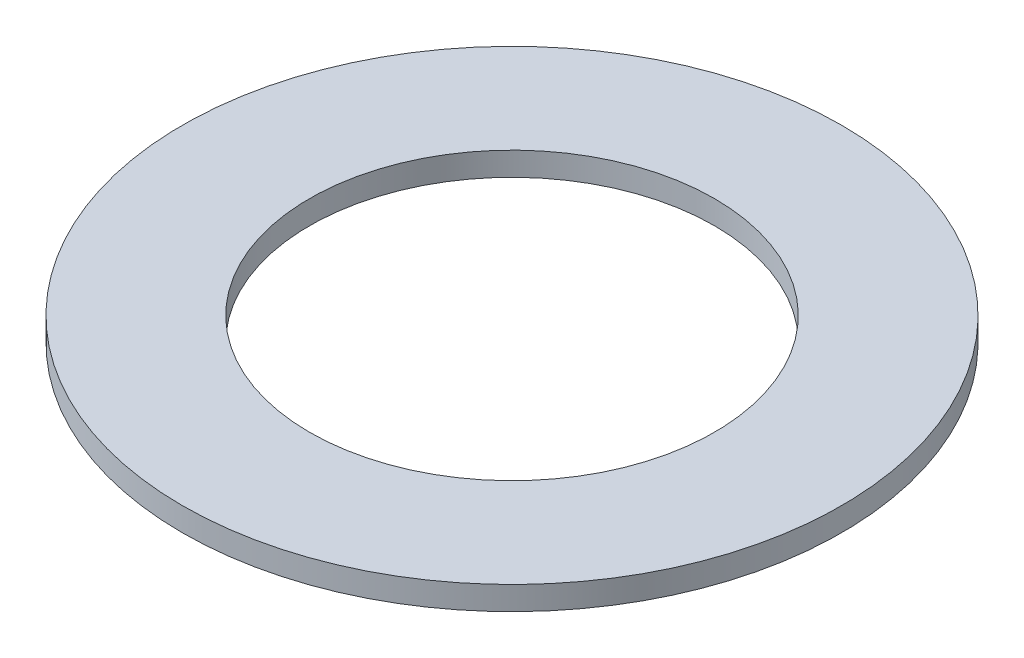
ISO-10303-21;
HEADER;
FILE_DESCRIPTION(('STEP AP214'),'2;1');
FILE_NAME('part.step','',(''),(''),'','','');
FILE_SCHEMA(('AUTOMOTIVE_DESIGN { 1 0 10303 214 1 1 1 1 }'));
ENDSEC;
DATA;
#1=APPLICATION_CONTEXT('core data for automotive mechanical design processes');
#2=APPLICATION_PROTOCOL_DEFINITION('international standard','automotive_design',2000,#1);
#3=PRODUCT_CONTEXT('',#1,'mechanical');
#4=PRODUCT('Part','Part','',(#3));
#5=PRODUCT_RELATED_PRODUCT_CATEGORY('part','',(#4));
#6=PRODUCT_DEFINITION_FORMATION('','',#4);
#7=PRODUCT_DEFINITION_CONTEXT('part definition',#1,'design');
#8=PRODUCT_DEFINITION('design','',#6,#7);
#9=PRODUCT_DEFINITION_SHAPE('','',#8);
#10=(LENGTH_UNIT() NAMED_UNIT(*) SI_UNIT(.MILLI.,.METRE.));
#11=(NAMED_UNIT(*) PLANE_ANGLE_UNIT() SI_UNIT($,.RADIAN.));
#12=(NAMED_UNIT(*) SI_UNIT($,.STERADIAN.) SOLID_ANGLE_UNIT());
#13=UNCERTAINTY_MEASURE_WITH_UNIT(LENGTH_MEASURE(1.E-05),#10,'distance_accuracy_value','');
#14=(GEOMETRIC_REPRESENTATION_CONTEXT(3) GLOBAL_UNCERTAINTY_ASSIGNED_CONTEXT((#13)) GLOBAL_UNIT_ASSIGNED_CONTEXT((#10,
#11,#12)) REPRESENTATION_CONTEXT('',''));
#15=CARTESIAN_POINT('',(0.,0.,0.));
#16=DIRECTION('',(0.,0.,1.));
#17=DIRECTION('',(1.,0.,0.));
#18=AXIS2_PLACEMENT_3D('',#15,#16,#17);
#19=CARTESIAN_POINT('',(0.,0.5,0.));
#20=DIRECTION('',(0.,1.,0.));
#21=DIRECTION('',(0.,0.,1.));
#22=AXIS2_PLACEMENT_3D('',#19,#20,#21);
#23=PLANE('',#22);
#24=CARTESIAN_POINT('',(0.,0.5,0.));
#25=DIRECTION('',(0.,1.,0.));
#26=DIRECTION('',(0.,0.,1.));
#27=AXIS2_PLACEMENT_3D('',#24,#25,#26);
#28=CIRCLE('',#27,7.);
#29=CARTESIAN_POINT('',(0.,0.5,7.));
#30=VERTEX_POINT('',#29);
#31=EDGE_CURVE('E10',#30,#30,#28,.T.);
#32=ORIENTED_EDGE('',*,*,#31,.T.);
#33=EDGE_LOOP('',(#32));
#34=FACE_BOUND('',#33,.T.);
#35=CARTESIAN_POINT('',(0.,0.5,0.));
#36=DIRECTION('',(0.,1.,0.));
#37=DIRECTION('',(0.,0.,1.));
#38=AXIS2_PLACEMENT_3D('',#35,#36,#37);
#39=CIRCLE('',#38,4.3);
#40=CARTESIAN_POINT('',(0.,0.5,4.3));
#41=VERTEX_POINT('',#40);
#42=EDGE_CURVE('E50',#41,#41,#39,.T.);
#43=ORIENTED_EDGE('',*,*,#42,.F.);
#44=EDGE_LOOP('',(#43));
#45=FACE_BOUND('',#44,.T.);
#46=ADVANCED_FACE('F37',(#34,#45),#23,.T.);
#47=CARTESIAN_POINT('',(0.,0.,0.));
#48=DIRECTION('',(0.,1.,0.));
#49=DIRECTION('',(0.,0.,1.));
#50=AXIS2_PLACEMENT_3D('',#47,#48,#49);
#51=PLANE('',#50);
#52=CARTESIAN_POINT('',(0.,0.,0.));
#53=DIRECTION('',(0.,1.,0.));
#54=DIRECTION('',(0.,0.,1.));
#55=AXIS2_PLACEMENT_3D('',#52,#53,#54);
#56=CIRCLE('',#55,7.);
#57=CARTESIAN_POINT('',(0.,0.,7.));
#58=VERTEX_POINT('',#57);
#59=EDGE_CURVE('E41',#58,#58,#56,.T.);
#60=ORIENTED_EDGE('',*,*,#59,.F.);
#61=EDGE_LOOP('',(#60));
#62=FACE_BOUND('',#61,.T.);
#63=CARTESIAN_POINT('',(0.,0.,0.));
#64=DIRECTION('',(0.,1.,0.));
#65=DIRECTION('',(0.,0.,1.));
#66=AXIS2_PLACEMENT_3D('',#63,#64,#65);
#67=CIRCLE('',#66,4.3);
#68=CARTESIAN_POINT('',(0.,0.,4.3));
#69=VERTEX_POINT('',#68);
#70=EDGE_CURVE('E52',#69,#69,#67,.T.);
#71=ORIENTED_EDGE('',*,*,#70,.T.);
#72=EDGE_LOOP('',(#71));
#73=FACE_BOUND('',#72,.T.);
#74=ADVANCED_FACE('F64',(#62,#73),#51,.F.);
#75=CARTESIAN_POINT('',(0.,0.5,0.));
#76=DIRECTION('',(0.,-1.,0.));
#77=DIRECTION('',(0.,0.,-1.));
#78=AXIS2_PLACEMENT_3D('',#75,#76,#77);
#79=CYLINDRICAL_SURFACE('',#78,7.);
#80=ORIENTED_EDGE('',*,*,#31,.F.);
#81=EDGE_LOOP('',(#80));
#82=FACE_BOUND('',#81,.T.);
#83=ORIENTED_EDGE('',*,*,#59,.T.);
#84=EDGE_LOOP('',(#83));
#85=FACE_BOUND('',#84,.T.);
#86=ADVANCED_FACE('F39',(#82,#85),#79,.T.);
#87=CARTESIAN_POINT('',(0.,0.5,0.));
#88=DIRECTION('',(0.,-1.,0.));
#89=DIRECTION('',(0.,0.,-1.));
#90=AXIS2_PLACEMENT_3D('',#87,#88,#89);
#91=CYLINDRICAL_SURFACE('',#90,4.3);
#92=ORIENTED_EDGE('',*,*,#42,.T.);
#93=EDGE_LOOP('',(#92));
#94=FACE_BOUND('',#93,.T.);
#95=ORIENTED_EDGE('',*,*,#70,.F.);
#96=EDGE_LOOP('',(#95));
#97=FACE_BOUND('',#96,.T.);
#98=ADVANCED_FACE('F60',(#94,#97),#91,.F.);
#99=CLOSED_SHELL('',(#46,#74,#86,#98));
#100=MANIFOLD_SOLID_BREP('B2',#99);
#101=ADVANCED_BREP_SHAPE_REPRESENTATION('',(#18,#100),#14);
#102=SHAPE_DEFINITION_REPRESENTATION(#9,#101);
ENDSEC;
END-ISO-10303-21;
